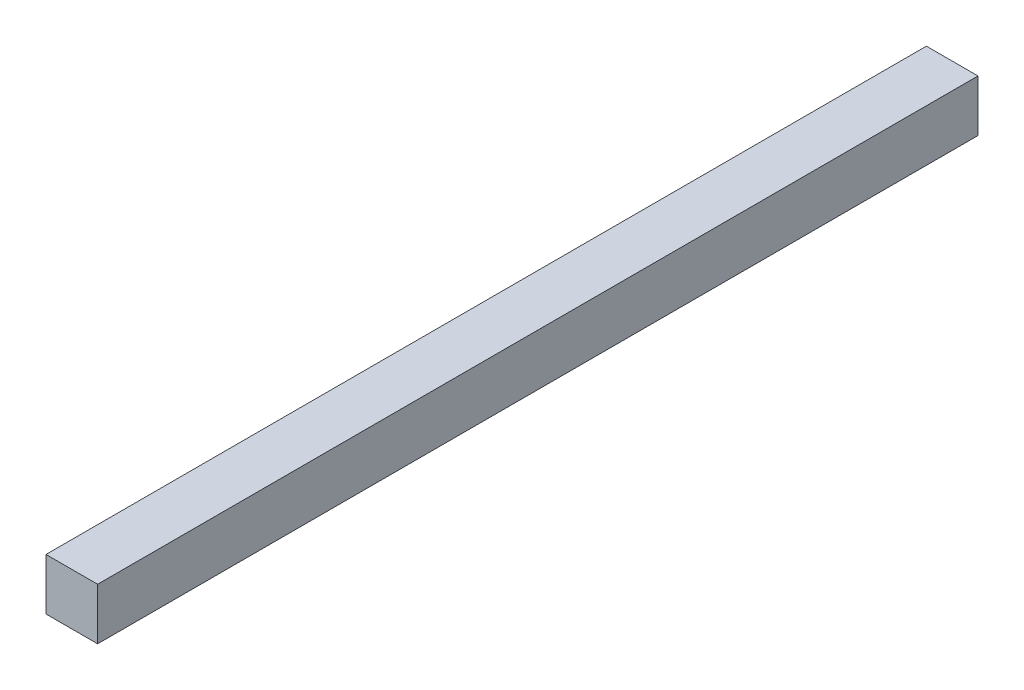
ISO-10303-21;
HEADER;
FILE_DESCRIPTION(('STEP AP214'),'2;1');
FILE_NAME('part.step','',(''),(''),'','','');
FILE_SCHEMA(('AUTOMOTIVE_DESIGN { 1 0 10303 214 1 1 1 1 }'));
ENDSEC;
DATA;
#1=APPLICATION_CONTEXT('core data for automotive mechanical design processes');
#2=APPLICATION_PROTOCOL_DEFINITION('international standard','automotive_design',2000,#1);
#3=PRODUCT_CONTEXT('',#1,'mechanical');
#4=PRODUCT('Part','Part','',(#3));
#5=PRODUCT_RELATED_PRODUCT_CATEGORY('part','',(#4));
#6=PRODUCT_DEFINITION_FORMATION('','',#4);
#7=PRODUCT_DEFINITION_CONTEXT('part definition',#1,'design');
#8=PRODUCT_DEFINITION('design','',#6,#7);
#9=PRODUCT_DEFINITION_SHAPE('','',#8);
#10=(LENGTH_UNIT() NAMED_UNIT(*) SI_UNIT(.MILLI.,.METRE.));
#11=(NAMED_UNIT(*) PLANE_ANGLE_UNIT() SI_UNIT($,.RADIAN.));
#12=(NAMED_UNIT(*) SI_UNIT($,.STERADIAN.) SOLID_ANGLE_UNIT());
#13=UNCERTAINTY_MEASURE_WITH_UNIT(LENGTH_MEASURE(1.E-05),#10,'distance_accuracy_value','');
#14=(GEOMETRIC_REPRESENTATION_CONTEXT(3) GLOBAL_UNCERTAINTY_ASSIGNED_CONTEXT((#13)) GLOBAL_UNIT_ASSIGNED_CONTEXT((#10,
#11,#12)) REPRESENTATION_CONTEXT('',''));
#15=CARTESIAN_POINT('',(0.,0.,0.));
#16=DIRECTION('',(0.,0.,1.));
#17=DIRECTION('',(1.,0.,0.));
#18=AXIS2_PLACEMENT_3D('',#15,#16,#17);
#19=CARTESIAN_POINT('',(0.,0.,597.));
#20=DIRECTION('',(0.,1.,0.));
#21=DIRECTION('',(0.,0.,1.));
#22=AXIS2_PLACEMENT_3D('',#19,#20,#21);
#23=PLANE('',#22);
#24=DIRECTION('',(1.,0.,0.));
#25=VECTOR('',#24,1.);
#26=CARTESIAN_POINT('',(0.,0.,0.));
#27=LINE('',#26,#25);
#28=CARTESIAN_POINT('',(0.,0.,0.));
#29=VERTEX_POINT('',#28);
#30=CARTESIAN_POINT('',(35.,0.,0.));
#31=VERTEX_POINT('',#30);
#32=EDGE_CURVE('E96',#29,#31,#27,.T.);
#33=ORIENTED_EDGE('',*,*,#32,.T.);
#34=DIRECTION('',(0.,0.,-1.));
#35=VECTOR('',#34,1.);
#36=CARTESIAN_POINT('',(35.,0.,597.));
#37=LINE('',#36,#35);
#38=CARTESIAN_POINT('',(35.,0.,597.));
#39=VERTEX_POINT('',#38);
#40=EDGE_CURVE('E11',#39,#31,#37,.T.);
#41=ORIENTED_EDGE('',*,*,#40,.F.);
#42=DIRECTION('',(1.,0.,0.));
#43=VECTOR('',#42,1.);
#44=CARTESIAN_POINT('',(0.,0.,597.));
#45=LINE('',#44,#43);
#46=CARTESIAN_POINT('',(0.,0.,597.));
#47=VERTEX_POINT('',#46);
#48=EDGE_CURVE('E82',#47,#39,#45,.T.);
#49=ORIENTED_EDGE('',*,*,#48,.F.);
#50=DIRECTION('',(0.,0.,-1.));
#51=VECTOR('',#50,1.);
#52=CARTESIAN_POINT('',(0.,0.,597.));
#53=LINE('',#52,#51);
#54=EDGE_CURVE('E49',#47,#29,#53,.T.);
#55=ORIENTED_EDGE('',*,*,#54,.T.);
#56=EDGE_LOOP('',(#33,#41,#49,#55));
#57=FACE_BOUND('',#56,.T.);
#58=ADVANCED_FACE('F33',(#57),#23,.F.);
#59=CARTESIAN_POINT('',(35.,0.,597.));
#60=DIRECTION('',(-1.,0.,0.));
#61=DIRECTION('',(0.,-1.,0.));
#62=AXIS2_PLACEMENT_3D('',#59,#60,#61);
#63=PLANE('',#62);
#64=DIRECTION('',(0.,1.,0.));
#65=VECTOR('',#64,1.);
#66=CARTESIAN_POINT('',(35.,0.,0.));
#67=LINE('',#66,#65);
#68=CARTESIAN_POINT('',(35.,35.,0.));
#69=VERTEX_POINT('',#68);
#70=EDGE_CURVE('E87',#31,#69,#67,.T.);
#71=ORIENTED_EDGE('',*,*,#70,.T.);
#72=DIRECTION('',(0.,0.,-1.));
#73=VECTOR('',#72,1.);
#74=CARTESIAN_POINT('',(35.,35.,597.));
#75=LINE('',#74,#73);
#76=CARTESIAN_POINT('',(35.,35.,597.));
#77=VERTEX_POINT('',#76);
#78=EDGE_CURVE('E41',#77,#69,#75,.T.);
#79=ORIENTED_EDGE('',*,*,#78,.F.);
#80=DIRECTION('',(0.,1.,0.));
#81=VECTOR('',#80,1.);
#82=CARTESIAN_POINT('',(35.,0.,597.));
#83=LINE('',#82,#81);
#84=EDGE_CURVE('E74',#39,#77,#83,.T.);
#85=ORIENTED_EDGE('',*,*,#84,.F.);
#86=ORIENTED_EDGE('',*,*,#40,.T.);
#87=EDGE_LOOP('',(#71,#79,#85,#86));
#88=FACE_BOUND('',#87,.T.);
#89=ADVANCED_FACE('F86',(#88),#63,.F.);
#90=CARTESIAN_POINT('',(0.,35.,597.));
#91=DIRECTION('',(0.,1.,0.));
#92=DIRECTION('',(0.,0.,1.));
#93=AXIS2_PLACEMENT_3D('',#90,#91,#92);
#94=PLANE('',#93);
#95=DIRECTION('',(1.,0.,0.));
#96=VECTOR('',#95,1.);
#97=CARTESIAN_POINT('',(0.,35.,0.));
#98=LINE('',#97,#96);
#99=CARTESIAN_POINT('',(0.,35.,0.));
#100=VERTEX_POINT('',#99);
#101=EDGE_CURVE('E99',#100,#69,#98,.T.);
#102=ORIENTED_EDGE('',*,*,#101,.F.);
#103=DIRECTION('',(0.,0.,-1.));
#104=VECTOR('',#103,1.);
#105=CARTESIAN_POINT('',(0.,35.,597.));
#106=LINE('',#105,#104);
#107=CARTESIAN_POINT('',(0.,35.,597.));
#108=VERTEX_POINT('',#107);
#109=EDGE_CURVE('E63',#108,#100,#106,.T.);
#110=ORIENTED_EDGE('',*,*,#109,.F.);
#111=DIRECTION('',(1.,0.,0.));
#112=VECTOR('',#111,1.);
#113=CARTESIAN_POINT('',(0.,35.,597.));
#114=LINE('',#113,#112);
#115=EDGE_CURVE('E81',#108,#77,#114,.T.);
#116=ORIENTED_EDGE('',*,*,#115,.T.);
#117=ORIENTED_EDGE('',*,*,#78,.T.);
#118=EDGE_LOOP('',(#102,#110,#116,#117));
#119=FACE_BOUND('',#118,.T.);
#120=ADVANCED_FACE('F90',(#119),#94,.T.);
#121=CARTESIAN_POINT('',(0.,0.,597.));
#122=DIRECTION('',(-1.,0.,0.));
#123=DIRECTION('',(0.,-1.,0.));
#124=AXIS2_PLACEMENT_3D('',#121,#122,#123);
#125=PLANE('',#124);
#126=DIRECTION('',(0.,1.,0.));
#127=VECTOR('',#126,1.);
#128=CARTESIAN_POINT('',(0.,0.,0.));
#129=LINE('',#128,#127);
#130=EDGE_CURVE('E101',#29,#100,#129,.T.);
#131=ORIENTED_EDGE('',*,*,#130,.F.);
#132=ORIENTED_EDGE('',*,*,#54,.F.);
#133=DIRECTION('',(0.,1.,0.));
#134=VECTOR('',#133,1.);
#135=CARTESIAN_POINT('',(0.,0.,597.));
#136=LINE('',#135,#134);
#137=EDGE_CURVE('E91',#47,#108,#136,.T.);
#138=ORIENTED_EDGE('',*,*,#137,.T.);
#139=ORIENTED_EDGE('',*,*,#109,.T.);
#140=EDGE_LOOP('',(#131,#132,#138,#139));
#141=FACE_BOUND('',#140,.T.);
#142=ADVANCED_FACE('F107',(#141),#125,.T.);
#143=CARTESIAN_POINT('',(0.,0.,597.));
#144=DIRECTION('',(0.,0.,1.));
#145=DIRECTION('',(1.,0.,0.));
#146=AXIS2_PLACEMENT_3D('',#143,#144,#145);
#147=PLANE('',#146);
#148=ORIENTED_EDGE('',*,*,#48,.T.);
#149=ORIENTED_EDGE('',*,*,#84,.T.);
#150=ORIENTED_EDGE('',*,*,#115,.F.);
#151=ORIENTED_EDGE('',*,*,#137,.F.);
#152=EDGE_LOOP('',(#148,#149,#150,#151));
#153=FACE_BOUND('',#152,.T.);
#154=ADVANCED_FACE('F78',(#153),#147,.T.);
#155=CARTESIAN_POINT('',(0.,0.,0.));
#156=DIRECTION('',(0.,0.,1.));
#157=DIRECTION('',(1.,0.,0.));
#158=AXIS2_PLACEMENT_3D('',#155,#156,#157);
#159=PLANE('',#158);
#160=ORIENTED_EDGE('',*,*,#32,.F.);
#161=ORIENTED_EDGE('',*,*,#130,.T.);
#162=ORIENTED_EDGE('',*,*,#101,.T.);
#163=ORIENTED_EDGE('',*,*,#70,.F.);
#164=EDGE_LOOP('',(#160,#161,#162,#163));
#165=FACE_BOUND('',#164,.T.);
#166=ADVANCED_FACE('F106',(#165),#159,.F.);
#167=CLOSED_SHELL('',(#58,#89,#120,#142,#154,#166));
#168=MANIFOLD_SOLID_BREP('B2',#167);
#169=ADVANCED_BREP_SHAPE_REPRESENTATION('',(#18,#168),#14);
#170=SHAPE_DEFINITION_REPRESENTATION(#9,#169);
ENDSEC;
END-ISO-10303-21;
